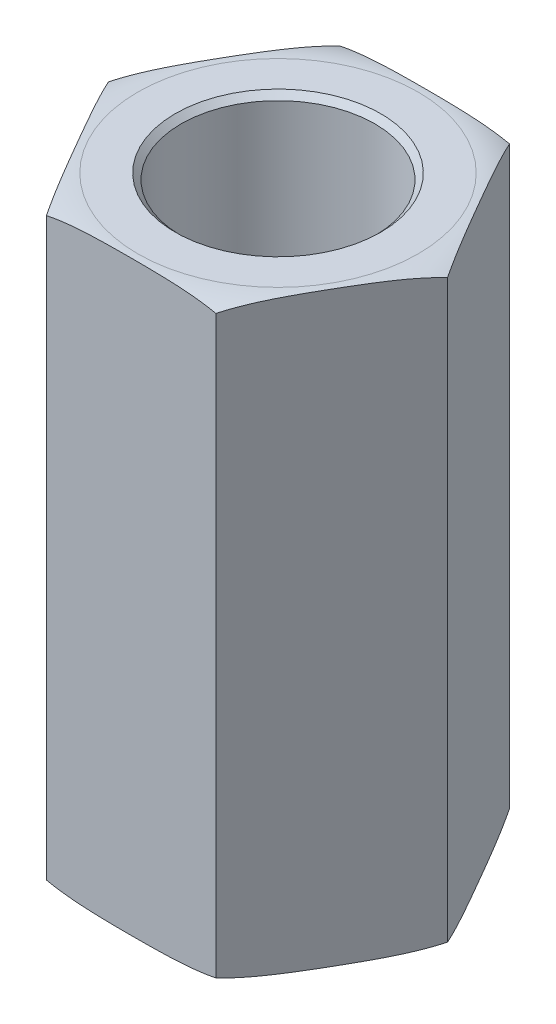
ISO-10303-21;
HEADER;
FILE_DESCRIPTION(('STEP AP214'),'2;1');
FILE_NAME('part.step','',(''),(''),'','','');
FILE_SCHEMA(('AUTOMOTIVE_DESIGN { 1 0 10303 214 1 1 1 1 }'));
ENDSEC;
DATA;
#1=APPLICATION_CONTEXT('core data for automotive mechanical design processes');
#2=APPLICATION_PROTOCOL_DEFINITION('international standard','automotive_design',2000,#1);
#3=PRODUCT_CONTEXT('',#1,'mechanical');
#4=PRODUCT('Part','Part','',(#3));
#5=PRODUCT_RELATED_PRODUCT_CATEGORY('part','',(#4));
#6=PRODUCT_DEFINITION_FORMATION('','',#4);
#7=PRODUCT_DEFINITION_CONTEXT('part definition',#1,'design');
#8=PRODUCT_DEFINITION('design','',#6,#7);
#9=PRODUCT_DEFINITION_SHAPE('','',#8);
#10=(LENGTH_UNIT() NAMED_UNIT(*) SI_UNIT(.MILLI.,.METRE.));
#11=(NAMED_UNIT(*) PLANE_ANGLE_UNIT() SI_UNIT($,.RADIAN.));
#12=(NAMED_UNIT(*) SI_UNIT($,.STERADIAN.) SOLID_ANGLE_UNIT());
#13=UNCERTAINTY_MEASURE_WITH_UNIT(LENGTH_MEASURE(1.E-05),#10,'distance_accuracy_value','');
#14=(GEOMETRIC_REPRESENTATION_CONTEXT(3) GLOBAL_UNCERTAINTY_ASSIGNED_CONTEXT((#13)) GLOBAL_UNIT_ASSIGNED_CONTEXT((#10,
#11,#12)) REPRESENTATION_CONTEXT('',''));
#15=CARTESIAN_POINT('',(0.,0.,0.));
#16=DIRECTION('',(0.,0.,1.));
#17=DIRECTION('',(1.,0.,0.));
#18=AXIS2_PLACEMENT_3D('',#15,#16,#17);
#19=CARTESIAN_POINT('',(3.66617420935412,6.35,0.));
#20=DIRECTION('',(-0.866025403784439,0.,0.5));
#21=DIRECTION('',(0.5,0.,0.866025403784439));
#22=AXIS2_PLACEMENT_3D('',#19,#20,#21);
#23=PLANE('',#22);
#24=DIRECTION('',(0.,1.,0.));
#25=VECTOR('',#24,1.);
#26=CARTESIAN_POINT('',(1.83308710467704,6.35,-3.175));
#27=LINE('',#26,#25);
#28=CARTESIAN_POINT('',(1.83308710467705,-6.223,-3.175));
#29=VERTEX_POINT('',#28);
#30=CARTESIAN_POINT('',(1.83308710467706,6.223,-3.175));
#31=VERTEX_POINT('',#30);
#32=EDGE_CURVE('E143',#29,#31,#27,.T.);
#33=ORIENTED_EDGE('',*,*,#32,.T.);
#34=CARTESIAN_POINT('',(3.66617420935412,6.223,0.));
#35=CARTESIAN_POINT('',(3.62797961467394,6.23890141489968,-0.0661549785605611));
#36=CARTESIAN_POINT('',(3.58956810864156,6.2524886076105,-0.132685658603882));
#37=CARTESIAN_POINT('',(3.5124905179571,6.27581619794021,-0.266187961794374));
#38=CARTESIAN_POINT('',(3.47382473049845,6.28556047713974,-0.33315907018741));
#39=CARTESIAN_POINT('',(3.39641631867871,6.3019966530451,-0.467234372392409));
#40=CARTESIAN_POINT('',(3.3576739963331,6.30869453286691,-0.534338043098217));
#41=CARTESIAN_POINT('',(3.28009834620111,6.31977675729319,-0.668703010557023));
#42=CARTESIAN_POINT('',(3.24126499587768,6.32416045047396,-0.735964346345314));
#43=CARTESIAN_POINT('',(3.16354065964311,6.33124030042628,-0.870586845688153));
#44=CARTESIAN_POINT('',(3.12464965374472,6.33393552375912,-0.937948043861629));
#45=CARTESIAN_POINT('',(3.04685144594589,6.33815319837134,-1.07269849250701));
#46=CARTESIAN_POINT('',(3.00794424351965,6.33967560802717,-1.14008774388963));
#47=CARTESIAN_POINT('',(2.93051517598868,6.34192270588903,-1.27419882283594));
#48=CARTESIAN_POINT('',(2.89199336248929,6.34265524681808,-1.34092056101658));
#49=CARTESIAN_POINT('',(2.81494778346138,6.34357673025741,-1.47436741839149));
#50=CARTESIAN_POINT('',(2.77642401791433,6.3437656658949,-1.54109253761784));
#51=CARTESIAN_POINT('',(2.69935964431006,6.34366599668056,-1.67457194815391));
#52=CARTESIAN_POINT('',(2.66081903631815,6.34337718117655,-1.7413262393505));
#53=CARTESIAN_POINT('',(2.58373908085323,6.34222198621899,-1.87483263846089));
#54=CARTESIAN_POINT('',(2.54519973341238,6.34135559703857,-1.94158474631899));
#55=CARTESIAN_POINT('',(2.46812969629763,6.33878619406563,-2.07507396634296));
#56=CARTESIAN_POINT('',(2.42959900625957,6.33708322716165,-2.14181107913956));
#57=CARTESIAN_POINT('',(2.352556513409,6.3324387229726,-2.27525259109851));
#58=CARTESIAN_POINT('',(2.31404470975434,6.3294972471358,-2.3419569917195));
#59=CARTESIAN_POINT('',(2.25084206239936,6.32321741247487,-2.45142718811118));
#60=CARTESIAN_POINT('',(2.22613849337002,6.32039801104631,-2.49421502479829));
#61=CARTESIAN_POINT('',(2.17676945272221,6.31386967943035,-2.57972471152123));
#62=CARTESIAN_POINT('',(2.15210397034177,6.31016108091389,-2.62244658019735));
#63=CARTESIAN_POINT('',(2.1028275381169,6.30168027114968,-2.70779586442654));
#64=CARTESIAN_POINT('',(2.07821657107524,6.29690846570083,-2.7504233097661));
#65=CARTESIAN_POINT('',(2.02900094683545,6.28609877125158,-2.83566727147563));
#66=CARTESIAN_POINT('',(2.0043964608546,6.28005773130841,-2.87828349128859));
#67=CARTESIAN_POINT('',(1.95527325900931,6.26651383541611,-2.96336737271509));
#68=CARTESIAN_POINT('',(1.93075459617612,6.25901019780296,-3.00583494247583));
#69=CARTESIAN_POINT('',(1.8818215737317,6.24232035070844,-3.09058942351747));
#70=CARTESIAN_POINT('',(1.85740744053269,6.23313149780328,-3.13287594264091));
#71=CARTESIAN_POINT('',(1.83308710467705,6.223,-3.175));
#72=B_SPLINE_CURVE_WITH_KNOTS('',3,(#34,#35,#36,#37,#38,#39,#40,#41,#42,#43,#44,#45,#46,#47,#48,
#49,#50,#51,#52,#53,#54,#55,#56,#57,#58,#59,#60,#61,#62,#63,#64,#65,#66,#67,#68,#69,#70,#71),
.UNSPECIFIED.,.F.,.F.,(4,2,2,2,2,2,2,2,2,2,2,2,2,2,2,2,2,2,4),(0.,0.233977307817956,
0.467717675040722,0.700996973557543,0.934341903229807,1.16781571967247,1.40129782179833,
1.6324366580968,1.86357841666628,2.09482211846307,2.32606971471509,2.55730435147413,
2.7885275169443,2.93698369265101,3.08538458004485,3.23372892334593,3.38244598546619,
3.53124274626087,3.68027493713585),.UNSPECIFIED.);
#73=CARTESIAN_POINT('',(3.66617420935412,6.223,0.));
#74=VERTEX_POINT('',#73);
#75=EDGE_CURVE('E97',#74,#31,#72,.T.);
#76=ORIENTED_EDGE('',*,*,#75,.F.);
#77=DIRECTION('',(0.,1.,0.));
#78=VECTOR('',#77,1.);
#79=CARTESIAN_POINT('',(3.66617420935412,6.35,0.));
#80=LINE('',#79,#78);
#81=CARTESIAN_POINT('',(3.66617420935412,-6.223,0.));
#82=VERTEX_POINT('',#81);
#83=EDGE_CURVE('E145',#74,#82,#80,.F.);
#84=ORIENTED_EDGE('',*,*,#83,.T.);
#85=CARTESIAN_POINT('',(1.83308710467705,-6.223,-3.17500000000001));
#86=CARTESIAN_POINT('',(1.87128169935723,-6.23890141489968,-3.10884502143945));
#87=CARTESIAN_POINT('',(1.90969320538961,-6.2524886076105,-3.04231434139613));
#88=CARTESIAN_POINT('',(1.98677079607407,-6.2758161979402,-2.90881203820564));
#89=CARTESIAN_POINT('',(2.02543658353272,-6.28556047713974,-2.8418409298126));
#90=CARTESIAN_POINT('',(2.10284499535245,-6.30199665304509,-2.70776562760761));
#91=CARTESIAN_POINT('',(2.14158731769806,-6.30869453286691,-2.6406619569018));
#92=CARTESIAN_POINT('',(2.21916296783006,-6.31977675729319,-2.506296989443));
#93=CARTESIAN_POINT('',(2.25799631815348,-6.32416045047396,-2.43903565365471));
#94=CARTESIAN_POINT('',(2.33572065438805,-6.33124030042628,-2.30441315431187));
#95=CARTESIAN_POINT('',(2.37461166028644,-6.33393552375912,-2.2370519561384));
#96=CARTESIAN_POINT('',(2.45240986808527,-6.33815319837134,-2.10230150749301));
#97=CARTESIAN_POINT('',(2.49131707051151,-6.33967560802717,-2.0349122561104));
#98=CARTESIAN_POINT('',(2.56874613804247,-6.34192270588903,-1.90080117716409));
#99=CARTESIAN_POINT('',(2.60726795154186,-6.34265524681808,-1.83407943898346));
#100=CARTESIAN_POINT('',(2.68431353056977,-6.34357673025741,-1.70063258160855));
#101=CARTESIAN_POINT('',(2.72283729611682,-6.3437656658949,-1.63390746238219));
#102=CARTESIAN_POINT('',(2.79990166972109,-6.34366599668056,-1.50042805184613));
#103=CARTESIAN_POINT('',(2.838442277713,-6.34337718117655,-1.43367376064954));
#104=CARTESIAN_POINT('',(2.91552223317792,-6.34222198621899,-1.30016736153915));
#105=CARTESIAN_POINT('',(2.95406158061877,-6.34135559703857,-1.23341525368106));
#106=CARTESIAN_POINT('',(3.03113161773352,-6.33878619406563,-1.09992603365709));
#107=CARTESIAN_POINT('',(3.06966230777158,-6.33708322716165,-1.03318892086049));
#108=CARTESIAN_POINT('',(3.14670480062215,-6.3324387229726,-0.89974740890154));
#109=CARTESIAN_POINT('',(3.18521660427681,-6.3294972471358,-0.833043008280553));
#110=CARTESIAN_POINT('',(3.24841925163179,-6.32321741247488,-0.723572811888871));
#111=CARTESIAN_POINT('',(3.27312282066113,-6.32039801104631,-0.68078497520176));
#112=CARTESIAN_POINT('',(3.32249186130894,-6.31386967943036,-0.595275288478811));
#113=CARTESIAN_POINT('',(3.34715734368938,-6.3101610809139,-0.552553419802693));
#114=CARTESIAN_POINT('',(3.39643377591425,-6.30168027114969,-0.467204135573495));
#115=CARTESIAN_POINT('',(3.42104474295592,-6.29690846570084,-0.424576690233926));
#116=CARTESIAN_POINT('',(3.47026036719571,-6.28609877125159,-0.339332728524397));
#117=CARTESIAN_POINT('',(3.49486485317657,-6.28005773130841,-0.296716508711431));
#118=CARTESIAN_POINT('',(3.54398805502186,-6.26651383541611,-0.211632627284922));
#119=CARTESIAN_POINT('',(3.56850671785505,-6.25901019780296,-0.169165057524186));
#120=CARTESIAN_POINT('',(3.61743974029947,-6.24232035070844,-0.0844105764825379));
#121=CARTESIAN_POINT('',(3.64185387349848,-6.23313149780328,-0.0421240573590945));
#122=CARTESIAN_POINT('',(3.66617420935412,-6.223,0.));
#123=B_SPLINE_CURVE_WITH_KNOTS('',3,(#85,#86,#87,#88,#89,#90,#91,#92,#93,#94,#95,#96,#97,#98,
#99,#100,#101,#102,#103,#104,#105,#106,#107,#108,#109,#110,#111,#112,#113,#114,#115,#116,#117,
#118,#119,#120,#121,#122),.UNSPECIFIED.,.F.,.F.,(4,2,2,2,2,2,2,2,2,2,2,2,2,2,2,2,2,2,4),(0.,
0.233977307817951,0.467717675040713,0.700996973557529,0.934341903229788,1.16781571967244,
1.4012978217983,1.63243665809676,1.86357841666625,2.09482211846303,2.32606971471504,
2.55730435147408,2.78852751694424,2.93698369265097,3.08538458004482,3.23372892334591,
3.38244598546617,3.53124274626087,3.68027493713586),.UNSPECIFIED.);
#124=EDGE_CURVE('E221',#29,#82,#123,.T.);
#125=ORIENTED_EDGE('',*,*,#124,.F.);
#126=EDGE_LOOP('',(#33,#76,#84,#125));
#127=FACE_BOUND('',#126,.T.);
#128=ADVANCED_FACE('F17',(#127),#23,.F.);
#129=CARTESIAN_POINT('',(1.83308710467706,6.35,3.17499999999999));
#130=DIRECTION('',(-0.866025403784439,0.,-0.5));
#131=DIRECTION('',(-0.5,0.,0.866025403784439));
#132=AXIS2_PLACEMENT_3D('',#129,#130,#131);
#133=PLANE('',#132);
#134=ORIENTED_EDGE('',*,*,#83,.F.);
#135=CARTESIAN_POINT('',(1.83308710467706,6.223,3.17499999999999));
#136=CARTESIAN_POINT('',(1.87128169935724,6.23890141489968,3.10884502143943));
#137=CARTESIAN_POINT('',(1.90969320538962,6.2524886076105,3.04231434139611));
#138=CARTESIAN_POINT('',(1.98677079607408,6.27581619794021,2.90881203820562));
#139=CARTESIAN_POINT('',(2.02543658353273,6.28556047713974,2.84184092981258));
#140=CARTESIAN_POINT('',(2.10284499535247,6.3019966530451,2.70776562760758));
#141=CARTESIAN_POINT('',(2.14158731769808,6.30869453286691,2.64066195690177));
#142=CARTESIAN_POINT('',(2.21916296783007,6.31977675729319,2.50629698944297));
#143=CARTESIAN_POINT('',(2.2579963181535,6.32416045047396,2.43903565365468));
#144=CARTESIAN_POINT('',(2.33572065438807,6.33124030042628,2.30441315431184));
#145=CARTESIAN_POINT('',(2.37461166028646,6.33393552375912,2.23705195613836));
#146=CARTESIAN_POINT('',(2.45240986808529,6.33815319837134,2.10230150749298));
#147=CARTESIAN_POINT('',(2.49131707051153,6.33967560802717,2.03491225611036));
#148=CARTESIAN_POINT('',(2.5687461380425,6.34192270588903,1.90080117716405));
#149=CARTESIAN_POINT('',(2.60726795154189,6.34265524681808,1.83407943898341));
#150=CARTESIAN_POINT('',(2.6843135305698,6.34357673025741,1.7006325816085));
#151=CARTESIAN_POINT('',(2.72283729611685,6.3437656658949,1.63390746238215));
#152=CARTESIAN_POINT('',(2.79990166972112,6.34366599668056,1.50042805184608));
#153=CARTESIAN_POINT('',(2.83844227771304,6.34337718117655,1.43367376064949));
#154=CARTESIAN_POINT('',(2.91552223317796,6.34222198621899,1.3001673615391));
#155=CARTESIAN_POINT('',(2.9540615806188,6.34135559703857,1.233415253681));
#156=CARTESIAN_POINT('',(3.03113161773355,6.33878619406563,1.09992603365703));
#157=CARTESIAN_POINT('',(3.06966230777161,6.33708322716165,1.03318892086043));
#158=CARTESIAN_POINT('',(3.14670480062218,6.3324387229726,0.899747408901478));
#159=CARTESIAN_POINT('',(3.18521660427684,6.3294972471358,0.833043008280487));
#160=CARTESIAN_POINT('',(3.24841925163182,6.32321741247487,0.723572811888809));
#161=CARTESIAN_POINT('',(3.27312282066116,6.32039801104631,0.680784975201703));
#162=CARTESIAN_POINT('',(3.32249186130897,6.31386967943035,0.595275288478763));
#163=CARTESIAN_POINT('',(3.34715734368941,6.31016108091389,0.552553419802648));
#164=CARTESIAN_POINT('',(3.39643377591428,6.30168027114968,0.467204135573458));
#165=CARTESIAN_POINT('',(3.42104474295594,6.29690846570083,0.424576690233893));
#166=CARTESIAN_POINT('',(3.47026036719572,6.28609877125158,0.339332728524371));
#167=CARTESIAN_POINT('',(3.49486485317658,6.28005773130841,0.29671650871141));
#168=CARTESIAN_POINT('',(3.54398805502187,6.26651383541611,0.211632627284908));
#169=CARTESIAN_POINT('',(3.56850671785506,6.25901019780296,0.169165057524176));
#170=CARTESIAN_POINT('',(3.61743974029948,6.24232035070844,0.0844105764825357));
#171=CARTESIAN_POINT('',(3.64185387349849,6.23313149780328,0.0421240573590963));
#172=CARTESIAN_POINT('',(3.66617420935412,6.223,0.));
#173=B_SPLINE_CURVE_WITH_KNOTS('',3,(#135,#136,#137,#138,#139,#140,#141,#142,#143,#144,#145,
#146,#147,#148,#149,#150,#151,#152,#153,#154,#155,#156,#157,#158,#159,#160,#161,#162,#163,#164,
#165,#166,#167,#168,#169,#170,#171,#172),.UNSPECIFIED.,.F.,.F.,(4,2,2,2,2,2,2,2,2,2,2,2,2,2,2,2,
2,2,4),(0.,0.233977307817956,0.467717675040722,0.700996973557543,0.934341903229808,
1.16781571967247,1.40129782179833,1.6324366580968,1.86357841666628,2.09482211846307,
2.32606971471509,2.55730435147413,2.7885275169443,2.93698369265101,3.08538458004485,
3.23372892334593,3.38244598546618,3.53124274626086,3.68027493713584),.UNSPECIFIED.);
#174=CARTESIAN_POINT('',(1.83308710467706,6.223,3.17499999999999));
#175=VERTEX_POINT('',#174);
#176=EDGE_CURVE('E214',#175,#74,#173,.T.);
#177=ORIENTED_EDGE('',*,*,#176,.F.);
#178=DIRECTION('',(0.,1.,0.));
#179=VECTOR('',#178,1.);
#180=CARTESIAN_POINT('',(1.83308710467706,6.35,3.17499999999999));
#181=LINE('',#180,#179);
#182=CARTESIAN_POINT('',(1.83308710467706,-6.223,3.17499999999999));
#183=VERTEX_POINT('',#182);
#184=EDGE_CURVE('E140',#175,#183,#181,.F.);
#185=ORIENTED_EDGE('',*,*,#184,.T.);
#186=CARTESIAN_POINT('',(3.66617420935412,-6.223,0.));
#187=CARTESIAN_POINT('',(3.62797961467394,-6.23890141489968,0.0661549785605662));
#188=CARTESIAN_POINT('',(3.58956810864156,-6.2524886076105,0.132685658603887));
#189=CARTESIAN_POINT('',(3.5124905179571,-6.27581619794021,0.266187961794379));
#190=CARTESIAN_POINT('',(3.47382473049845,-6.28556047713974,0.333159070187415));
#191=CARTESIAN_POINT('',(3.39641631867871,-6.3019966530451,0.467234372392414));
#192=CARTESIAN_POINT('',(3.3576739963331,-6.30869453286691,0.534338043098222));
#193=CARTESIAN_POINT('',(3.28009834620111,-6.31977675729319,0.668703010557028));
#194=CARTESIAN_POINT('',(3.24126499587768,-6.32416045047396,0.73596434634532));
#195=CARTESIAN_POINT('',(3.16354065964311,-6.33124030042628,0.870586845688159));
#196=CARTESIAN_POINT('',(3.12464965374472,-6.33393552375912,0.937948043861634));
#197=CARTESIAN_POINT('',(3.04685144594589,-6.33815319837134,1.07269849250702));
#198=CARTESIAN_POINT('',(3.00794424351965,-6.33967560802717,1.14008774388963));
#199=CARTESIAN_POINT('',(2.93051517598868,-6.34192270588903,1.27419882283595));
#200=CARTESIAN_POINT('',(2.89199336248929,-6.34265524681808,1.34092056101658));
#201=CARTESIAN_POINT('',(2.81494778346138,-6.34357673025741,1.47436741839149));
#202=CARTESIAN_POINT('',(2.77642401791433,-6.3437656658949,1.54109253761785));
#203=CARTESIAN_POINT('',(2.69935964431006,-6.34366599668056,1.67457194815392));
#204=CARTESIAN_POINT('',(2.66081903631815,-6.34337718117655,1.74132623935051));
#205=CARTESIAN_POINT('',(2.58373908085322,-6.34222198621899,1.8748326384609));
#206=CARTESIAN_POINT('',(2.54519973341238,-6.34135559703857,1.941584746319));
#207=CARTESIAN_POINT('',(2.46812969629763,-6.33878619406563,2.07507396634296));
#208=CARTESIAN_POINT('',(2.42959900625957,-6.33708322716165,2.14181107913957));
#209=CARTESIAN_POINT('',(2.352556513409,-6.3324387229726,2.27525259109852));
#210=CARTESIAN_POINT('',(2.31404470975434,-6.3294972471358,2.34195699171951));
#211=CARTESIAN_POINT('',(2.25084206239936,-6.32321741247487,2.45142718811119));
#212=CARTESIAN_POINT('',(2.22613849337002,-6.32039801104631,2.49421502479829));
#213=CARTESIAN_POINT('',(2.17676945272221,-6.31386967943035,2.57972471152123));
#214=CARTESIAN_POINT('',(2.15210397034177,-6.31016108091389,2.62244658019735));
#215=CARTESIAN_POINT('',(2.1028275381169,-6.30168027114968,2.70779586442654));
#216=CARTESIAN_POINT('',(2.07821657107524,-6.29690846570083,2.7504233097661));
#217=CARTESIAN_POINT('',(2.02900094683546,-6.28609877125158,2.83566727147563));
#218=CARTESIAN_POINT('',(2.0043964608546,-6.28005773130841,2.87828349128859));
#219=CARTESIAN_POINT('',(1.95527325900931,-6.26651383541611,2.96336737271509));
#220=CARTESIAN_POINT('',(1.93075459617612,-6.25901019780296,3.00583494247582));
#221=CARTESIAN_POINT('',(1.88182157373171,-6.24232035070844,3.09058942351746));
#222=CARTESIAN_POINT('',(1.8574074405327,-6.23313149780328,3.1328759426409));
#223=CARTESIAN_POINT('',(1.83308710467706,-6.223,3.17499999999999));
#224=B_SPLINE_CURVE_WITH_KNOTS('',3,(#186,#187,#188,#189,#190,#191,#192,#193,#194,#195,#196,
#197,#198,#199,#200,#201,#202,#203,#204,#205,#206,#207,#208,#209,#210,#211,#212,#213,#214,#215,
#216,#217,#218,#219,#220,#221,#222,#223),.UNSPECIFIED.,.F.,.F.,(4,2,2,2,2,2,2,2,2,2,2,2,2,2,2,2,
2,2,4),(0.,0.233977307817956,0.467717675040723,0.700996973557543,0.934341903229807,
1.16781571967247,1.40129782179833,1.6324366580968,1.86357841666628,2.09482211846307,
2.32606971471509,2.55730435147414,2.7885275169443,2.93698369265102,3.08538458004485,
3.23372892334593,3.38244598546618,3.53124274626086,3.68027493713584),.UNSPECIFIED.);
#225=EDGE_CURVE('E240',#82,#183,#224,.T.);
#226=ORIENTED_EDGE('',*,*,#225,.F.);
#227=EDGE_LOOP('',(#134,#177,#185,#226));
#228=FACE_BOUND('',#227,.T.);
#229=ADVANCED_FACE('F218',(#228),#133,.F.);
#230=CARTESIAN_POINT('',(1.83308710467706,6.35,-3.175));
#231=DIRECTION('',(0.,0.,1.));
#232=DIRECTION('',(1.,0.,0.));
#233=AXIS2_PLACEMENT_3D('',#230,#231,#232);
#234=PLANE('',#233);
#235=DIRECTION('',(0.,1.,0.));
#236=VECTOR('',#235,1.);
#237=CARTESIAN_POINT('',(-1.83308710467707,6.35,-3.175));
#238=LINE('',#237,#236);
#239=CARTESIAN_POINT('',(-1.83308710467707,-6.223,-3.175));
#240=VERTEX_POINT('',#239);
#241=CARTESIAN_POINT('',(-1.83308710467706,6.223,-3.17500000000001));
#242=VERTEX_POINT('',#241);
#243=EDGE_CURVE('E104',#240,#242,#238,.T.);
#244=ORIENTED_EDGE('',*,*,#243,.T.);
#245=CARTESIAN_POINT('',(1.83308710467706,6.223,-3.175));
#246=CARTESIAN_POINT('',(1.73237579828683,6.24394001415179,-3.175));
#247=CARTESIAN_POINT('',(1.63096506893486,6.26088534953273,-3.175));
#248=CARTESIAN_POINT('',(1.42767146651469,6.28849716439842,-3.175));
#249=CARTESIAN_POINT('',(1.32579191427254,6.29918756587531,-3.175));
#250=CARTESIAN_POINT('',(1.12177634709137,6.31612804080793,-3.175));
#251=CARTESIAN_POINT('',(1.0196405664338,6.32238127071887,-3.175));
#252=CARTESIAN_POINT('',(0.815663681397375,6.33190280641833,-3.175));
#253=CARTESIAN_POINT('',(0.713823115514573,6.3351834044999,-3.175));
#254=CARTESIAN_POINT('',(0.510018485441651,6.33994548487028,-3.175));
#255=CARTESIAN_POINT('',(0.408054390577976,6.34142541008817,-3.175));
#256=CARTESIAN_POINT('',(0.20406020033787,6.34331468183792,-3.175));
#257=CARTESIAN_POINT('',(0.102030100168935,6.3437234241492,-3.175));
#258=CARTESIAN_POINT('',(-0.102030100168934,6.3437234241492,-3.175));
#259=CARTESIAN_POINT('',(-0.204060200337869,6.34331468183792,-3.175));
#260=CARTESIAN_POINT('',(-0.408054390577974,6.34142541008817,-3.175));
#261=CARTESIAN_POINT('',(-0.510018485441649,6.33994548487028,-3.175));
#262=CARTESIAN_POINT('',(-0.71382311551457,6.3351834044999,-3.175));
#263=CARTESIAN_POINT('',(-0.815663681397372,6.33190280641833,-3.175));
#264=CARTESIAN_POINT('',(-1.01964056643379,6.32238127071887,-3.175));
#265=CARTESIAN_POINT('',(-1.12177634709137,6.31612804080793,-3.175));
#266=CARTESIAN_POINT('',(-1.32579191427253,6.29918756587531,-3.175));
#267=CARTESIAN_POINT('',(-1.42767146651468,6.28849716439842,-3.175));
#268=CARTESIAN_POINT('',(-1.63096506893485,6.26088534953273,-3.175));
#269=CARTESIAN_POINT('',(-1.73237579828682,6.24394001415179,-3.175));
#270=CARTESIAN_POINT('',(-1.83308710467705,6.223,-3.175));
#271=B_SPLINE_CURVE_WITH_KNOTS('',3,(#245,#246,#247,#248,#249,#250,#251,#252,#253,#254,#255,
#256,#257,#258,#259,#260,#261,#262,#263,#264,#265,#266,#267,#268,#269,#270),.UNSPECIFIED.,.F.,
.F.,(4,2,2,2,2,2,2,2,2,2,2,2,4),(0.,0.308333242342807,0.615479423308234,0.922406891130008,
1.2280592962085,1.53397581645216,1.84006485747889,2.14615389850561,2.45207041874927,
2.75772282382776,3.06465029164953,3.37179647261496,3.68012971495777),.UNSPECIFIED.);
#272=EDGE_CURVE('E89',#31,#242,#271,.T.);
#273=ORIENTED_EDGE('',*,*,#272,.F.);
#274=ORIENTED_EDGE('',*,*,#32,.F.);
#275=CARTESIAN_POINT('',(-1.83308710467707,-6.223,-3.175));
#276=CARTESIAN_POINT('',(-1.73237579828684,-6.24394001415179,-3.175));
#277=CARTESIAN_POINT('',(-1.63096506893487,-6.26088534953273,-3.175));
#278=CARTESIAN_POINT('',(-1.4276714665147,-6.28849716439842,-3.175));
#279=CARTESIAN_POINT('',(-1.32579191427255,-6.2991875658753,-3.175));
#280=CARTESIAN_POINT('',(-1.12177634709138,-6.31612804080793,-3.175));
#281=CARTESIAN_POINT('',(-1.0196405664338,-6.32238127071887,-3.175));
#282=CARTESIAN_POINT('',(-0.81566368139738,-6.33190280641833,-3.175));
#283=CARTESIAN_POINT('',(-0.713823115514577,-6.3351834044999,-3.175));
#284=CARTESIAN_POINT('',(-0.510018485441654,-6.33994548487028,-3.175));
#285=CARTESIAN_POINT('',(-0.408054390577979,-6.34142541008817,-3.175));
#286=CARTESIAN_POINT('',(-0.204060200337872,-6.34331468183792,-3.175));
#287=CARTESIAN_POINT('',(-0.102030100168936,-6.3437234241492,-3.175));
#288=CARTESIAN_POINT('',(0.102030100168934,-6.3437234241492,-3.175));
#289=CARTESIAN_POINT('',(0.204060200337869,-6.34331468183792,-3.175));
#290=CARTESIAN_POINT('',(0.408054390577974,-6.34142541008817,-3.175));
#291=CARTESIAN_POINT('',(0.510018485441648,-6.33994548487028,-3.175));
#292=CARTESIAN_POINT('',(0.713823115514568,-6.3351834044999,-3.175));
#293=CARTESIAN_POINT('',(0.81566368139737,-6.33190280641833,-3.175));
#294=CARTESIAN_POINT('',(1.01964056643379,-6.32238127071887,-3.175));
#295=CARTESIAN_POINT('',(1.12177634709137,-6.31612804080793,-3.175));
#296=CARTESIAN_POINT('',(1.32579191427253,-6.29918756587531,-3.175));
#297=CARTESIAN_POINT('',(1.42767146651468,-6.28849716439842,-3.175));
#298=CARTESIAN_POINT('',(1.63096506893485,-6.26088534953273,-3.175));
#299=CARTESIAN_POINT('',(1.73237579828682,-6.24394001415179,-3.175));
#300=CARTESIAN_POINT('',(1.83308710467705,-6.223,-3.175));
#301=B_SPLINE_CURVE_WITH_KNOTS('',3,(#275,#276,#277,#278,#279,#280,#281,#282,#283,#284,#285,
#286,#287,#288,#289,#290,#291,#292,#293,#294,#295,#296,#297,#298,#299,#300),.UNSPECIFIED.,.F.,
.F.,(4,2,2,2,2,2,2,2,2,2,2,2,4),(0.,0.308333242342808,0.615479423308238,0.922406891130013,
1.22805929620851,1.53397581645217,1.8400648574789,2.14615389850562,2.45207041874928,
2.75772282382777,3.06465029164954,3.37179647261497,3.68012971495777),.UNSPECIFIED.);
#302=EDGE_CURVE('E106',#240,#29,#301,.T.);
#303=ORIENTED_EDGE('',*,*,#302,.F.);
#304=EDGE_LOOP('',(#244,#273,#274,#303));
#305=FACE_BOUND('',#304,.T.);
#306=ADVANCED_FACE('F105',(#305),#234,.F.);
#307=CARTESIAN_POINT('',(-1.83308710467707,6.35,3.175));
#308=DIRECTION('',(0.,0.,-1.));
#309=DIRECTION('',(-1.,0.,0.));
#310=AXIS2_PLACEMENT_3D('',#307,#308,#309);
#311=PLANE('',#310);
#312=ORIENTED_EDGE('',*,*,#184,.F.);
#313=CARTESIAN_POINT('',(-1.83308710467706,6.223,3.175));
#314=CARTESIAN_POINT('',(-1.73237579828684,6.24394001415179,3.175));
#315=CARTESIAN_POINT('',(-1.63096506893486,6.26088534953273,3.175));
#316=CARTESIAN_POINT('',(-1.42767146651469,6.28849716439842,3.175));
#317=CARTESIAN_POINT('',(-1.32579191427254,6.29918756587531,3.175));
#318=CARTESIAN_POINT('',(-1.12177634709138,6.31612804080793,3.175));
#319=CARTESIAN_POINT('',(-1.0196405664338,6.32238127071887,3.175));
#320=CARTESIAN_POINT('',(-0.815663681397378,6.33190280641833,3.175));
#321=CARTESIAN_POINT('',(-0.713823115514575,6.3351834044999,3.175));
#322=CARTESIAN_POINT('',(-0.510018485441652,6.33994548487028,3.175));
#323=CARTESIAN_POINT('',(-0.408054390577977,6.34142541008817,3.175));
#324=CARTESIAN_POINT('',(-0.204060200337871,6.34331468183792,3.175));
#325=CARTESIAN_POINT('',(-0.102030100168935,6.3437234241492,3.17499999999999));
#326=CARTESIAN_POINT('',(0.102030100168935,6.3437234241492,3.17499999999999));
#327=CARTESIAN_POINT('',(0.204060200337871,6.34331468183792,3.17499999999999));
#328=CARTESIAN_POINT('',(0.408054390577978,6.34142541008817,3.17499999999999));
#329=CARTESIAN_POINT('',(0.510018485441652,6.33994548487028,3.17499999999999));
#330=CARTESIAN_POINT('',(0.713823115514575,6.3351834044999,3.17499999999999));
#331=CARTESIAN_POINT('',(0.815663681397378,6.33190280641833,3.17499999999999));
#332=CARTESIAN_POINT('',(1.0196405664338,6.32238127071887,3.17499999999999));
#333=CARTESIAN_POINT('',(1.12177634709138,6.31612804080793,3.17499999999999));
#334=CARTESIAN_POINT('',(1.32579191427254,6.29918756587531,3.17499999999999));
#335=CARTESIAN_POINT('',(1.42767146651469,6.28849716439842,3.17499999999999));
#336=CARTESIAN_POINT('',(1.63096506893486,6.26088534953273,3.17499999999999));
#337=CARTESIAN_POINT('',(1.73237579828684,6.24394001415179,3.17499999999999));
#338=CARTESIAN_POINT('',(1.83308710467706,6.223,3.17499999999999));
#339=B_SPLINE_CURVE_WITH_KNOTS('',3,(#313,#314,#315,#316,#317,#318,#319,#320,#321,#322,#323,
#324,#325,#326,#327,#328,#329,#330,#331,#332,#333,#334,#335,#336,#337,#338),.UNSPECIFIED.,.F.,
.F.,(4,2,2,2,2,2,2,2,2,2,2,2,4),(0.,0.308333242342808,0.615479423308237,0.922406891130011,
1.2280592962085,1.53397581645216,1.84006485747889,2.14615389850562,2.45207041874928,
2.75772282382777,3.06465029164955,3.37179647261498,3.68012971495778),.UNSPECIFIED.);
#340=CARTESIAN_POINT('',(-1.83308710467707,6.223,3.175));
#341=VERTEX_POINT('',#340);
#342=EDGE_CURVE('E100',#341,#175,#339,.T.);
#343=ORIENTED_EDGE('',*,*,#342,.F.);
#344=DIRECTION('',(0.,1.,0.));
#345=VECTOR('',#344,1.);
#346=CARTESIAN_POINT('',(-1.83308710467707,6.35,3.175));
#347=LINE('',#346,#345);
#348=CARTESIAN_POINT('',(-1.83308710467706,-6.223,3.175));
#349=VERTEX_POINT('',#348);
#350=EDGE_CURVE('E108',#341,#349,#347,.F.);
#351=ORIENTED_EDGE('',*,*,#350,.T.);
#352=CARTESIAN_POINT('',(1.83308710467706,-6.223,3.17499999999999));
#353=CARTESIAN_POINT('',(1.73237579828684,-6.24394001415179,3.17499999999999));
#354=CARTESIAN_POINT('',(1.63096506893486,-6.26088534953273,3.17499999999999));
#355=CARTESIAN_POINT('',(1.4276714665147,-6.28849716439842,3.17499999999999));
#356=CARTESIAN_POINT('',(1.32579191427254,-6.29918756587531,3.17499999999999));
#357=CARTESIAN_POINT('',(1.12177634709138,-6.31612804080793,3.17499999999999));
#358=CARTESIAN_POINT('',(1.0196405664338,-6.32238127071887,3.17499999999999));
#359=CARTESIAN_POINT('',(0.815663681397378,-6.33190280641833,3.17499999999999));
#360=CARTESIAN_POINT('',(0.713823115514575,-6.3351834044999,3.17499999999999));
#361=CARTESIAN_POINT('',(0.510018485441653,-6.33994548487028,3.17499999999999));
#362=CARTESIAN_POINT('',(0.408054390577978,-6.34142541008817,3.17499999999999));
#363=CARTESIAN_POINT('',(0.204060200337871,-6.34331468183792,3.17499999999999));
#364=CARTESIAN_POINT('',(0.102030100168935,-6.3437234241492,3.17499999999999));
#365=CARTESIAN_POINT('',(-0.102030100168935,-6.3437234241492,3.17499999999999));
#366=CARTESIAN_POINT('',(-0.204060200337871,-6.34331468183792,3.175));
#367=CARTESIAN_POINT('',(-0.408054390577977,-6.34142541008817,3.175));
#368=CARTESIAN_POINT('',(-0.510018485441652,-6.33994548487028,3.175));
#369=CARTESIAN_POINT('',(-0.713823115514575,-6.3351834044999,3.175));
#370=CARTESIAN_POINT('',(-0.815663681397377,-6.33190280641833,3.175));
#371=CARTESIAN_POINT('',(-1.0196405664338,-6.32238127071887,3.175));
#372=CARTESIAN_POINT('',(-1.12177634709138,-6.31612804080793,3.175));
#373=CARTESIAN_POINT('',(-1.32579191427254,-6.29918756587531,3.175));
#374=CARTESIAN_POINT('',(-1.42767146651469,-6.28849716439842,3.175));
#375=CARTESIAN_POINT('',(-1.63096506893486,-6.26088534953273,3.175));
#376=CARTESIAN_POINT('',(-1.73237579828684,-6.24394001415179,3.175));
#377=CARTESIAN_POINT('',(-1.83308710467706,-6.223,3.175));
#378=B_SPLINE_CURVE_WITH_KNOTS('',3,(#352,#353,#354,#355,#356,#357,#358,#359,#360,#361,#362,
#363,#364,#365,#366,#367,#368,#369,#370,#371,#372,#373,#374,#375,#376,#377),.UNSPECIFIED.,.F.,
.F.,(4,2,2,2,2,2,2,2,2,2,2,2,4),(0.,0.308333242342808,0.615479423308237,0.922406891130012,
1.2280592962085,1.53397581645216,1.84006485747889,2.14615389850562,2.45207041874928,
2.75772282382777,3.06465029164955,3.37179647261498,3.68012971495778),.UNSPECIFIED.);
#379=EDGE_CURVE('E208',#183,#349,#378,.T.);
#380=ORIENTED_EDGE('',*,*,#379,.F.);
#381=EDGE_LOOP('',(#312,#343,#351,#380));
#382=FACE_BOUND('',#381,.T.);
#383=ADVANCED_FACE('F369',(#382),#311,.F.);
#384=CARTESIAN_POINT('',(-3.66617420935413,6.35,0.));
#385=DIRECTION('',(0.866025403784439,0.,-0.499999999999999));
#386=DIRECTION('',(-0.499999999999999,0.,-0.866025403784439));
#387=AXIS2_PLACEMENT_3D('',#384,#385,#386);
#388=PLANE('',#387);
#389=ORIENTED_EDGE('',*,*,#350,.F.);
#390=CARTESIAN_POINT('',(-3.66617420935412,6.223,0.));
#391=CARTESIAN_POINT('',(-3.62797961467395,6.23890141489968,0.0661549785605658));
#392=CARTESIAN_POINT('',(-3.58956810864157,6.2524886076105,0.132685658603887));
#393=CARTESIAN_POINT('',(-3.5124905179571,6.27581619794021,0.266187961794379));
#394=CARTESIAN_POINT('',(-3.47382473049845,6.28556047713974,0.333159070187414));
#395=CARTESIAN_POINT('',(-3.39641631867872,6.30199665304509,0.467234372392414));
#396=CARTESIAN_POINT('',(-3.35767399633311,6.30869453286691,0.534338043098221));
#397=CARTESIAN_POINT('',(-3.28009834620111,6.31977675729319,0.668703010557027));
#398=CARTESIAN_POINT('',(-3.24126499587769,6.32416045047396,0.735964346345319));
#399=CARTESIAN_POINT('',(-3.16354065964312,6.33124030042628,0.870586845688157));
#400=CARTESIAN_POINT('',(-3.12464965374473,6.33393552375912,0.937948043861633));
#401=CARTESIAN_POINT('',(-3.04685144594589,6.33815319837134,1.07269849250702));
#402=CARTESIAN_POINT('',(-3.00794424351966,6.33967560802717,1.14008774388963));
#403=CARTESIAN_POINT('',(-2.93051517598869,6.34192270588903,1.27419882283594));
#404=CARTESIAN_POINT('',(-2.8919933624893,6.34265524681808,1.34092056101658));
#405=CARTESIAN_POINT('',(-2.81494778346139,6.34357673025741,1.47436741839149));
#406=CARTESIAN_POINT('',(-2.77642401791434,6.3437656658949,1.54109253761785));
#407=CARTESIAN_POINT('',(-2.69935964431007,6.34366599668056,1.67457194815392));
#408=CARTESIAN_POINT('',(-2.66081903631815,6.34337718117655,1.7413262393505));
#409=CARTESIAN_POINT('',(-2.58373908085323,6.34222198621899,1.87483263846089));
#410=CARTESIAN_POINT('',(-2.54519973341239,6.34135559703857,1.94158474631899));
#411=CARTESIAN_POINT('',(-2.46812969629764,6.33878619406563,2.07507396634296));
#412=CARTESIAN_POINT('',(-2.42959900625958,6.33708322716165,2.14181107913956));
#413=CARTESIAN_POINT('',(-2.35255651340901,6.3324387229726,2.27525259109852));
#414=CARTESIAN_POINT('',(-2.31404470975435,6.3294972471358,2.3419569917195));
#415=CARTESIAN_POINT('',(-2.25084206239937,6.32321741247487,2.45142718811118));
#416=CARTESIAN_POINT('',(-2.22613849337003,6.32039801104631,2.49421502479829));
#417=CARTESIAN_POINT('',(-2.17676945272222,6.31386967943035,2.57972471152123));
#418=CARTESIAN_POINT('',(-2.15210397034178,6.31016108091389,2.62244658019735));
#419=CARTESIAN_POINT('',(-2.10282753811691,6.30168027114968,2.70779586442654));
#420=CARTESIAN_POINT('',(-2.07821657107525,6.29690846570083,2.7504233097661));
#421=CARTESIAN_POINT('',(-2.02900094683546,6.28609877125158,2.83566727147563));
#422=CARTESIAN_POINT('',(-2.00439646085461,6.28005773130841,2.87828349128859));
#423=CARTESIAN_POINT('',(-1.95527325900932,6.26651383541611,2.96336737271509));
#424=CARTESIAN_POINT('',(-1.93075459617613,6.25901019780295,3.00583494247582));
#425=CARTESIAN_POINT('',(-1.88182157373171,6.24232035070844,3.09058942351747));
#426=CARTESIAN_POINT('',(-1.8574074405327,6.23313149780328,3.13287594264091));
#427=CARTESIAN_POINT('',(-1.83308710467707,6.223,3.175));
#428=B_SPLINE_CURVE_WITH_KNOTS('',3,(#390,#391,#392,#393,#394,#395,#396,#397,#398,#399,#400,
#401,#402,#403,#404,#405,#406,#407,#408,#409,#410,#411,#412,#413,#414,#415,#416,#417,#418,#419,
#420,#421,#422,#423,#424,#425,#426,#427),.UNSPECIFIED.,.F.,.F.,(4,2,2,2,2,2,2,2,2,2,2,2,2,2,2,2,
2,2,4),(0.,0.233977307817955,0.467717675040721,0.700996973557541,0.934341903229805,
1.16781571967247,1.40129782179833,1.63243665809679,1.86357841666628,2.09482211846307,
2.32606971471509,2.55730435147413,2.78852751694429,2.93698369265101,3.08538458004484,
3.23372892334593,3.38244598546618,3.53124274626086,3.68027493713584),.UNSPECIFIED.);
#429=CARTESIAN_POINT('',(-3.66617420935413,6.223,0.));
#430=VERTEX_POINT('',#429);
#431=EDGE_CURVE('E101',#430,#341,#428,.T.);
#432=ORIENTED_EDGE('',*,*,#431,.F.);
#433=DIRECTION('',(0.,1.,0.));
#434=VECTOR('',#433,1.);
#435=CARTESIAN_POINT('',(-3.66617420935413,6.35,0.));
#436=LINE('',#435,#434);
#437=CARTESIAN_POINT('',(-3.66617420935412,-6.223,0.));
#438=VERTEX_POINT('',#437);
#439=EDGE_CURVE('E83',#430,#438,#436,.F.);
#440=ORIENTED_EDGE('',*,*,#439,.T.);
#441=CARTESIAN_POINT('',(-1.83308710467707,-6.223,3.175));
#442=CARTESIAN_POINT('',(-1.87128169935724,-6.23890141489968,3.10884502143944));
#443=CARTESIAN_POINT('',(-1.90969320538962,-6.25248860761049,3.04231434139612));
#444=CARTESIAN_POINT('',(-1.98677079607408,-6.2758161979402,2.90881203820563));
#445=CARTESIAN_POINT('',(-2.02543658353273,-6.28556047713974,2.8418409298126));
#446=CARTESIAN_POINT('',(-2.10284499535247,-6.30199665304509,2.7077656276076));
#447=CARTESIAN_POINT('',(-2.14158731769808,-6.30869453286691,2.64066195690179));
#448=CARTESIAN_POINT('',(-2.21916296783007,-6.31977675729319,2.50629698944299));
#449=CARTESIAN_POINT('',(-2.25799631815349,-6.32416045047396,2.4390356536547));
#450=CARTESIAN_POINT('',(-2.33572065438806,-6.33124030042628,2.30441315431186));
#451=CARTESIAN_POINT('',(-2.37461166028645,-6.33393552375911,2.23705195613839));
#452=CARTESIAN_POINT('',(-2.45240986808529,-6.33815319837134,2.102301507493));
#453=CARTESIAN_POINT('',(-2.49131707051152,-6.33967560802717,2.03491225611039));
#454=CARTESIAN_POINT('',(-2.56874613804249,-6.34192270588903,1.90080117716408));
#455=CARTESIAN_POINT('',(-2.60726795154188,-6.34265524681808,1.83407943898344));
#456=CARTESIAN_POINT('',(-2.68431353056979,-6.34357673025741,1.70063258160854));
#457=CARTESIAN_POINT('',(-2.72283729611684,-6.3437656658949,1.63390746238218));
#458=CARTESIAN_POINT('',(-2.79990166972111,-6.34366599668056,1.50042805184611));
#459=CARTESIAN_POINT('',(-2.83844227771302,-6.34337718117655,1.43367376064953));
#460=CARTESIAN_POINT('',(-2.91552223317794,-6.34222198621899,1.30016736153914));
#461=CARTESIAN_POINT('',(-2.95406158061879,-6.34135559703857,1.23341525368104));
#462=CARTESIAN_POINT('',(-3.03113161773353,-6.33878619406563,1.09992603365708));
#463=CARTESIAN_POINT('',(-3.06966230777159,-6.33708322716165,1.03318892086047));
#464=CARTESIAN_POINT('',(-3.14670480062216,-6.3324387229726,0.899747408901525));
#465=CARTESIAN_POINT('',(-3.18521660427682,-6.3294972471358,0.833043008280536));
#466=CARTESIAN_POINT('',(-3.2484192516318,-6.32321741247488,0.723572811888856));
#467=CARTESIAN_POINT('',(-3.27312282066114,-6.32039801104631,0.680784975201748));
#468=CARTESIAN_POINT('',(-3.32249186130896,-6.31386967943036,0.595275288478802));
#469=CARTESIAN_POINT('',(-3.3471573436894,-6.31016108091389,0.552553419802685));
#470=CARTESIAN_POINT('',(-3.39643377591426,-6.30168027114968,0.467204135573489));
#471=CARTESIAN_POINT('',(-3.42104474295593,-6.29690846570083,0.424576690233921));
#472=CARTESIAN_POINT('',(-3.47026036719571,-6.28609877125159,0.339332728524393));
#473=CARTESIAN_POINT('',(-3.49486485317657,-6.28005773130841,0.296716508711429));
#474=CARTESIAN_POINT('',(-3.54398805502187,-6.26651383541611,0.211632627284922));
#475=CARTESIAN_POINT('',(-3.56850671785506,-6.25901019780296,0.169165057524188));
#476=CARTESIAN_POINT('',(-3.61743974029948,-6.24232035070844,0.0844105764825412));
#477=CARTESIAN_POINT('',(-3.64185387349849,-6.23313149780328,0.0421240573590989));
#478=CARTESIAN_POINT('',(-3.66617420935412,-6.223,0.));
#479=B_SPLINE_CURVE_WITH_KNOTS('',3,(#441,#442,#443,#444,#445,#446,#447,#448,#449,#450,#451,
#452,#453,#454,#455,#456,#457,#458,#459,#460,#461,#462,#463,#464,#465,#466,#467,#468,#469,#470,
#471,#472,#473,#474,#475,#476,#477,#478),.UNSPECIFIED.,.F.,.F.,(4,2,2,2,2,2,2,2,2,2,2,2,2,2,2,2,
2,2,4),(0.,0.233977307817952,0.467717675040714,0.700996973557531,0.934341903229791,
1.16781571967245,1.40129782179831,1.63243665809677,1.86357841666625,2.09482211846303,
2.32606971471505,2.55730435147409,2.78852751694425,2.93698369265097,3.08538458004482,
3.23372892334591,3.38244598546616,3.53124274626086,3.68027493713585),.UNSPECIFIED.);
#480=EDGE_CURVE('E162',#349,#438,#479,.T.);
#481=ORIENTED_EDGE('',*,*,#480,.F.);
#482=EDGE_LOOP('',(#389,#432,#440,#481));
#483=FACE_BOUND('',#482,.T.);
#484=ADVANCED_FACE('F211',(#483),#388,.F.);
#485=CARTESIAN_POINT('',(-1.83308710467707,6.35,-3.175));
#486=DIRECTION('',(0.866025403784439,0.,0.5));
#487=DIRECTION('',(0.5,0.,-0.866025403784439));
#488=AXIS2_PLACEMENT_3D('',#485,#486,#487);
#489=PLANE('',#488);
#490=ORIENTED_EDGE('',*,*,#439,.F.);
#491=CARTESIAN_POINT('',(-1.83308710467706,6.22299999999999,-3.17500000000001));
#492=CARTESIAN_POINT('',(-1.87128169935723,6.23890141489968,-3.10884502143945));
#493=CARTESIAN_POINT('',(-1.90969320538961,6.25248860761049,-3.04231434139613));
#494=CARTESIAN_POINT('',(-1.98677079607408,6.2758161979402,-2.90881203820565));
#495=CARTESIAN_POINT('',(-2.02543658353272,6.28556047713973,-2.84184092981261));
#496=CARTESIAN_POINT('',(-2.10284499535246,6.30199665304509,-2.70776562760762));
#497=CARTESIAN_POINT('',(-2.14158731769807,6.30869453286691,-2.64066195690181));
#498=CARTESIAN_POINT('',(-2.21916296783006,6.31977675729319,-2.50629698944301));
#499=CARTESIAN_POINT('',(-2.25799631815348,6.32416045047396,-2.43903565365472));
#500=CARTESIAN_POINT('',(-2.33572065438805,6.33124030042628,-2.30441315431188));
#501=CARTESIAN_POINT('',(-2.37461166028644,6.33393552375911,-2.23705195613841));
#502=CARTESIAN_POINT('',(-2.45240986808527,6.33815319837134,-2.10230150749303));
#503=CARTESIAN_POINT('',(-2.49131707051151,6.33967560802717,-2.03491225611042));
#504=CARTESIAN_POINT('',(-2.56874613804247,6.34192270588903,-1.90080117716411));
#505=CARTESIAN_POINT('',(-2.60726795154186,6.34265524681808,-1.83407943898348));
#506=CARTESIAN_POINT('',(-2.68431353056977,6.34357673025741,-1.70063258160857));
#507=CARTESIAN_POINT('',(-2.72283729611682,6.3437656658949,-1.63390746238222));
#508=CARTESIAN_POINT('',(-2.79990166972109,6.34366599668056,-1.50042805184615));
#509=CARTESIAN_POINT('',(-2.838442277713,6.34337718117655,-1.43367376064956));
#510=CARTESIAN_POINT('',(-2.91552223317792,6.34222198621899,-1.30016736153918));
#511=CARTESIAN_POINT('',(-2.95406158061877,6.34135559703857,-1.23341525368108));
#512=CARTESIAN_POINT('',(-3.03113161773352,6.33878619406563,-1.09992603365712));
#513=CARTESIAN_POINT('',(-3.06966230777157,6.33708322716165,-1.03318892086051));
#514=CARTESIAN_POINT('',(-3.14670480062214,6.3324387229726,-0.899747408901567));
#515=CARTESIAN_POINT('',(-3.1852166042768,6.3294972471358,-0.83304300828058));
#516=CARTESIAN_POINT('',(-3.24841925163178,6.32321741247488,-0.723572811888898));
#517=CARTESIAN_POINT('',(-3.27312282066112,6.32039801104631,-0.680784975201786));
#518=CARTESIAN_POINT('',(-3.32249186130894,6.31386967943036,-0.595275288478835));
#519=CARTESIAN_POINT('',(-3.34715734368938,6.3101610809139,-0.552553419802715));
#520=CARTESIAN_POINT('',(-3.39643377591425,6.30168027114968,-0.467204135573515));
#521=CARTESIAN_POINT('',(-3.42104474295592,6.29690846570084,-0.424576690233944));
#522=CARTESIAN_POINT('',(-3.47026036719571,6.28609877125159,-0.339332728524412));
#523=CARTESIAN_POINT('',(-3.49486485317657,6.28005773130841,-0.296716508711445));
#524=CARTESIAN_POINT('',(-3.54398805502186,6.26651383541611,-0.211632627284932));
#525=CARTESIAN_POINT('',(-3.56850671785506,6.25901019780296,-0.169165057524196));
#526=CARTESIAN_POINT('',(-3.61743974029948,6.24232035070844,-0.0844105764825444));
#527=CARTESIAN_POINT('',(-3.64185387349849,6.23313149780328,-0.0421240573590995));
#528=CARTESIAN_POINT('',(-3.66617420935413,6.223,0.));
#529=B_SPLINE_CURVE_WITH_KNOTS('',3,(#491,#492,#493,#494,#495,#496,#497,#498,#499,#500,#501,
#502,#503,#504,#505,#506,#507,#508,#509,#510,#511,#512,#513,#514,#515,#516,#517,#518,#519,#520,
#521,#522,#523,#524,#525,#526,#527,#528),.UNSPECIFIED.,.F.,.F.,(4,2,2,2,2,2,2,2,2,2,2,2,2,2,2,2,
2,2,4),(0.,0.233977307817949,0.467717675040709,0.700996973557522,0.934341903229779,
1.16781571967243,1.40129782179829,1.63243665809675,1.86357841666623,2.09482211846301,
2.32606971471502,2.55730435147406,2.78852751694422,2.93698369265095,3.0853845800448,
3.2337289233459,3.38244598546616,3.53124274626087,3.68027493713586),.UNSPECIFIED.);
#530=EDGE_CURVE('E94',#242,#430,#529,.T.);
#531=ORIENTED_EDGE('',*,*,#530,.F.);
#532=ORIENTED_EDGE('',*,*,#243,.F.);
#533=CARTESIAN_POINT('',(-3.66617420935413,-6.223,0.));
#534=CARTESIAN_POINT('',(-3.62797961467395,-6.23890141489968,-0.0661549785605638));
#535=CARTESIAN_POINT('',(-3.58956810864157,-6.25248860761049,-0.132685658603884));
#536=CARTESIAN_POINT('',(-3.51249051795711,-6.2758161979402,-0.266187961794374));
#537=CARTESIAN_POINT('',(-3.47382473049846,-6.28556047713974,-0.333159070187409));
#538=CARTESIAN_POINT('',(-3.39641631867873,-6.30199665304509,-0.467234372392406));
#539=CARTESIAN_POINT('',(-3.35767399633312,-6.30869453286691,-0.534338043098213));
#540=CARTESIAN_POINT('',(-3.28009834620112,-6.31977675729319,-0.668703010557017));
#541=CARTESIAN_POINT('',(-3.2412649958777,-6.32416045047396,-0.735964346345307));
#542=CARTESIAN_POINT('',(-3.16354065964313,-6.33124030042628,-0.870586845688144));
#543=CARTESIAN_POINT('',(-3.12464965374474,-6.33393552375911,-0.937948043861619));
#544=CARTESIAN_POINT('',(-3.04685144594591,-6.33815319837134,-1.072698492507));
#545=CARTESIAN_POINT('',(-3.00794424351967,-6.33967560802717,-1.14008774388961));
#546=CARTESIAN_POINT('',(-2.9305151759887,-6.34192270588903,-1.27419882283593));
#547=CARTESIAN_POINT('',(-2.89199336248931,-6.34265524681808,-1.34092056101656));
#548=CARTESIAN_POINT('',(-2.8149477834614,-6.34357673025741,-1.47436741839147));
#549=CARTESIAN_POINT('',(-2.77642401791436,-6.3437656658949,-1.54109253761782));
#550=CARTESIAN_POINT('',(-2.69935964431008,-6.34366599668056,-1.67457194815389));
#551=CARTESIAN_POINT('',(-2.66081903631817,-6.34337718117655,-1.74132623935048));
#552=CARTESIAN_POINT('',(-2.58373908085325,-6.34222198621899,-1.87483263846087));
#553=CARTESIAN_POINT('',(-2.5451997334124,-6.34135559703857,-1.94158474631897));
#554=CARTESIAN_POINT('',(-2.46812969629765,-6.33878619406563,-2.07507396634293));
#555=CARTESIAN_POINT('',(-2.4295990062596,-6.33708322716165,-2.14181107913953));
#556=CARTESIAN_POINT('',(-2.35255651340903,-6.3324387229726,-2.27525259109848));
#557=CARTESIAN_POINT('',(-2.31404470975437,-6.3294972471358,-2.34195699171947));
#558=CARTESIAN_POINT('',(-2.25084206239939,-6.32321741247488,-2.45142718811115));
#559=CARTESIAN_POINT('',(-2.22613849337005,-6.32039801104631,-2.49421502479826));
#560=CARTESIAN_POINT('',(-2.17676945272223,-6.31386967943036,-2.57972471152121));
#561=CARTESIAN_POINT('',(-2.15210397034179,-6.31016108091389,-2.62244658019732));
#562=CARTESIAN_POINT('',(-2.10282753811692,-6.30168027114968,-2.70779586442652));
#563=CARTESIAN_POINT('',(-2.07821657107526,-6.29690846570083,-2.75042330976609));
#564=CARTESIAN_POINT('',(-2.02900094683547,-6.28609877125158,-2.83566727147561));
#565=CARTESIAN_POINT('',(-2.00439646085461,-6.28005773130841,-2.87828349128858));
#566=CARTESIAN_POINT('',(-1.95527325900932,-6.26651383541611,-2.96336737271509));
#567=CARTESIAN_POINT('',(-1.93075459617613,-6.25901019780295,-3.00583494247582));
#568=CARTESIAN_POINT('',(-1.88182157373171,-6.24232035070844,-3.09058942351747));
#569=CARTESIAN_POINT('',(-1.8574074405327,-6.23313149780328,-3.13287594264091));
#570=CARTESIAN_POINT('',(-1.83308710467707,-6.223,-3.175));
#571=B_SPLINE_CURVE_WITH_KNOTS('',3,(#533,#534,#535,#536,#537,#538,#539,#540,#541,#542,#543,
#544,#545,#546,#547,#548,#549,#550,#551,#552,#553,#554,#555,#556,#557,#558,#559,#560,#561,#562,
#563,#564,#565,#566,#567,#568,#569,#570),.UNSPECIFIED.,.F.,.F.,(4,2,2,2,2,2,2,2,2,2,2,2,2,2,2,2,
2,2,4),(0.,0.233977307817953,0.467717675040716,0.700996973557533,0.934341903229794,
1.16781571967245,1.40129782179831,1.63243665809677,1.86357841666626,2.09482211846304,
2.32606971471506,2.5573043514741,2.78852751694426,2.93698369265098,3.08538458004482,
3.23372892334591,3.38244598546617,3.53124274626086,3.68027493713585),.UNSPECIFIED.);
#572=EDGE_CURVE('E155',#438,#240,#571,.T.);
#573=ORIENTED_EDGE('',*,*,#572,.F.);
#574=EDGE_LOOP('',(#490,#531,#532,#573));
#575=FACE_BOUND('',#574,.T.);
#576=ADVANCED_FACE('F110',(#575),#489,.F.);
#577=CARTESIAN_POINT('',(0.,4.69899999999997,0.));
#578=DIRECTION('',(0.,1.,0.));
#579=DIRECTION('',(0.,0.,1.));
#580=AXIS2_PLACEMENT_3D('',#577,#578,#579);
#581=TOROIDAL_SURFACE('',#580,3.03117420935411,1.65100000000003);
#582=CARTESIAN_POINT('',(0.,6.35,0.));
#583=DIRECTION('',(0.,-1.,0.));
#584=DIRECTION('',(0.,0.,1.));
#585=AXIS2_PLACEMENT_3D('',#582,#583,#584);
#586=CIRCLE('',#585,3.03117420935412);
#587=CARTESIAN_POINT('',(0.,6.35,3.03117420935412));
#588=VERTEX_POINT('',#587);
#589=CARTESIAN_POINT('',(0.,6.35,-3.03117420935412));
#590=VERTEX_POINT('',#589);
#591=EDGE_CURVE('E161',#588,#590,#586,.T.);
#592=ORIENTED_EDGE('',*,*,#591,.T.);
#593=CARTESIAN_POINT('',(0.,6.35,0.));
#594=DIRECTION('',(0.,-1.,0.));
#595=DIRECTION('',(0.,0.,-1.));
#596=AXIS2_PLACEMENT_3D('',#593,#594,#595);
#597=CIRCLE('',#596,3.03117420935412);
#598=EDGE_CURVE('E197',#590,#588,#597,.T.);
#599=ORIENTED_EDGE('',*,*,#598,.T.);
#600=EDGE_LOOP('',(#592,#599));
#601=FACE_BOUND('',#600,.T.);
#602=ORIENTED_EDGE('',*,*,#176,.T.);
#603=ORIENTED_EDGE('',*,*,#75,.T.);
#604=ORIENTED_EDGE('',*,*,#272,.T.);
#605=ORIENTED_EDGE('',*,*,#530,.T.);
#606=ORIENTED_EDGE('',*,*,#431,.T.);
#607=ORIENTED_EDGE('',*,*,#342,.T.);
#608=EDGE_LOOP('',(#602,#603,#604,#605,#606,#607));
#609=FACE_BOUND('',#608,.T.);
#610=ADVANCED_FACE('F92',(#601,#609),#581,.T.);
#611=CARTESIAN_POINT('',(0.,-4.69899999999997,0.));
#612=DIRECTION('',(0.,-1.,0.));
#613=DIRECTION('',(0.,0.,1.));
#614=AXIS2_PLACEMENT_3D('',#611,#612,#613);
#615=TOROIDAL_SURFACE('',#614,3.03117420935411,1.65100000000003);
#616=CARTESIAN_POINT('',(0.,-6.35,0.));
#617=DIRECTION('',(0.,1.,0.));
#618=DIRECTION('',(0.,0.,1.));
#619=AXIS2_PLACEMENT_3D('',#616,#617,#618);
#620=CIRCLE('',#619,3.03117420935412);
#621=CARTESIAN_POINT('',(0.,-6.35,-3.03117420935412));
#622=VERTEX_POINT('',#621);
#623=CARTESIAN_POINT('',(0.,-6.35,3.03117420935412));
#624=VERTEX_POINT('',#623);
#625=EDGE_CURVE('E37',#622,#624,#620,.F.);
#626=ORIENTED_EDGE('',*,*,#625,.F.);
#627=CARTESIAN_POINT('',(0.,-6.35,0.));
#628=DIRECTION('',(0.,1.,0.));
#629=DIRECTION('',(0.,0.,-1.));
#630=AXIS2_PLACEMENT_3D('',#627,#628,#629);
#631=CIRCLE('',#630,3.03117420935412);
#632=EDGE_CURVE('E154',#624,#622,#631,.F.);
#633=ORIENTED_EDGE('',*,*,#632,.F.);
#634=EDGE_LOOP('',(#626,#633));
#635=FACE_BOUND('',#634,.T.);
#636=ORIENTED_EDGE('',*,*,#480,.T.);
#637=ORIENTED_EDGE('',*,*,#572,.T.);
#638=ORIENTED_EDGE('',*,*,#302,.T.);
#639=ORIENTED_EDGE('',*,*,#124,.T.);
#640=ORIENTED_EDGE('',*,*,#225,.T.);
#641=ORIENTED_EDGE('',*,*,#379,.T.);
#642=EDGE_LOOP('',(#636,#637,#638,#639,#640,#641));
#643=FACE_BOUND('',#642,.T.);
#644=ADVANCED_FACE('F167',(#635,#643),#615,.T.);
#645=CARTESIAN_POINT('',(-1.83308710467707,6.35,-3.175));
#646=DIRECTION('',(0.,-1.,0.));
#647=DIRECTION('',(0.,0.,-1.));
#648=AXIS2_PLACEMENT_3D('',#645,#646,#647);
#649=PLANE('',#648);
#650=ORIENTED_EDGE('',*,*,#591,.F.);
#651=ORIENTED_EDGE('',*,*,#598,.F.);
#652=EDGE_LOOP('',(#650,#651));
#653=FACE_BOUND('',#652,.T.);
#654=CARTESIAN_POINT('',(0.,6.34999999994079,0.));
#655=DIRECTION('',(0.,1.,0.));
#656=DIRECTION('',(-1.,0.,0.));
#657=AXIS2_PLACEMENT_3D('',#654,#655,#656);
#658=CIRCLE('',#657,2.22249999995938);
#659=CARTESIAN_POINT('',(-2.22249999995938,6.34999999994079,0.));
#660=VERTEX_POINT('',#659);
#661=EDGE_CURVE('E151',#660,#660,#658,.F.);
#662=ORIENTED_EDGE('',*,*,#661,.T.);
#663=EDGE_LOOP('',(#662));
#664=FACE_BOUND('',#663,.T.);
#665=ADVANCED_FACE('F172',(#653,#664),#649,.F.);
#666=CARTESIAN_POINT('',(-1.83308710467707,-6.35,-3.175));
#667=DIRECTION('',(0.,-1.,0.));
#668=DIRECTION('',(0.,0.,-1.));
#669=AXIS2_PLACEMENT_3D('',#666,#667,#668);
#670=PLANE('',#669);
#671=ORIENTED_EDGE('',*,*,#625,.T.);
#672=ORIENTED_EDGE('',*,*,#632,.T.);
#673=EDGE_LOOP('',(#671,#672));
#674=FACE_BOUND('',#673,.T.);
#675=CARTESIAN_POINT('',(0.,-6.34999999999764,0.));
#676=DIRECTION('',(0.,-1.,0.));
#677=DIRECTION('',(0.,0.,-1.));
#678=AXIS2_PLACEMENT_3D('',#675,#676,#677);
#679=CIRCLE('',#678,2.22249999995938);
#680=CARTESIAN_POINT('',(0.,-6.34999999999764,-2.22249999995938));
#681=VERTEX_POINT('',#680);
#682=EDGE_CURVE('E148',#681,#681,#679,.F.);
#683=ORIENTED_EDGE('',*,*,#682,.T.);
#684=EDGE_LOOP('',(#683));
#685=FACE_BOUND('',#684,.T.);
#686=ADVANCED_FACE('F201',(#674,#685),#670,.T.);
#687=CARTESIAN_POINT('',(0.,6.34999999988395,0.));
#688=DIRECTION('',(0.,1.,0.));
#689=DIRECTION('',(-1.,0.,0.));
#690=AXIS2_PLACEMENT_3D('',#687,#688,#689);
#691=CONICAL_SURFACE('',#690,2.22249999990254,0.785398163397448);
#692=ORIENTED_EDGE('',*,*,#661,.F.);
#693=EDGE_LOOP('',(#692));
#694=FACE_BOUND('',#693,.T.);
#695=CARTESIAN_POINT('',(0.,6.223,0.));
#696=DIRECTION('',(0.,1.,0.));
#697=DIRECTION('',(0.,0.,1.));
#698=AXIS2_PLACEMENT_3D('',#695,#696,#697);
#699=CIRCLE('',#698,2.0955);
#700=CARTESIAN_POINT('',(0.,6.223,2.0955));
#701=VERTEX_POINT('',#700);
#702=EDGE_CURVE('E29',#701,#701,#699,.F.);
#703=ORIENTED_EDGE('',*,*,#702,.T.);
#704=EDGE_LOOP('',(#703));
#705=FACE_BOUND('',#704,.T.);
#706=ADVANCED_FACE('F264',(#694,#705),#691,.F.);
#707=CARTESIAN_POINT('',(0.,-6.34999999994079,0.));
#708=DIRECTION('',(0.,-1.,0.));
#709=DIRECTION('',(0.,0.,-1.));
#710=AXIS2_PLACEMENT_3D('',#707,#708,#709);
#711=CONICAL_SURFACE('',#710,2.22249999990254,0.785398163397448);
#712=CARTESIAN_POINT('',(0.,-6.223,0.));
#713=DIRECTION('',(0.,1.,0.));
#714=DIRECTION('',(0.,0.,1.));
#715=AXIS2_PLACEMENT_3D('',#712,#713,#714);
#716=CIRCLE('',#715,2.0955);
#717=CARTESIAN_POINT('',(0.,-6.223,2.0955));
#718=VERTEX_POINT('',#717);
#719=EDGE_CURVE('E10',#718,#718,#716,.T.);
#720=ORIENTED_EDGE('',*,*,#719,.T.);
#721=EDGE_LOOP('',(#720));
#722=FACE_BOUND('',#721,.T.);
#723=ORIENTED_EDGE('',*,*,#682,.F.);
#724=EDGE_LOOP('',(#723));
#725=FACE_BOUND('',#724,.T.);
#726=ADVANCED_FACE('F258',(#722,#725),#711,.F.);
#727=CARTESIAN_POINT('',(0.,-6.35,0.));
#728=DIRECTION('',(0.,1.,0.));
#729=DIRECTION('',(0.,0.,1.));
#730=AXIS2_PLACEMENT_3D('',#727,#728,#729);
#731=CYLINDRICAL_SURFACE('',#730,2.0955);
#732=ORIENTED_EDGE('',*,*,#702,.F.);
#733=EDGE_LOOP('',(#732));
#734=FACE_BOUND('',#733,.T.);
#735=ORIENTED_EDGE('',*,*,#719,.F.);
#736=EDGE_LOOP('',(#735));
#737=FACE_BOUND('',#736,.T.);
#738=ADVANCED_FACE('F256',(#734,#737),#731,.F.);
#739=CLOSED_SHELL('',(#128,#229,#306,#383,#484,#576,#610,#644,#665,#686,#706,#726,#738));
#740=MANIFOLD_SOLID_BREP('B1',#739);
#741=ADVANCED_BREP_SHAPE_REPRESENTATION('',(#18,#740),#14);
#742=SHAPE_DEFINITION_REPRESENTATION(#9,#741);
ENDSEC;
END-ISO-10303-21;
